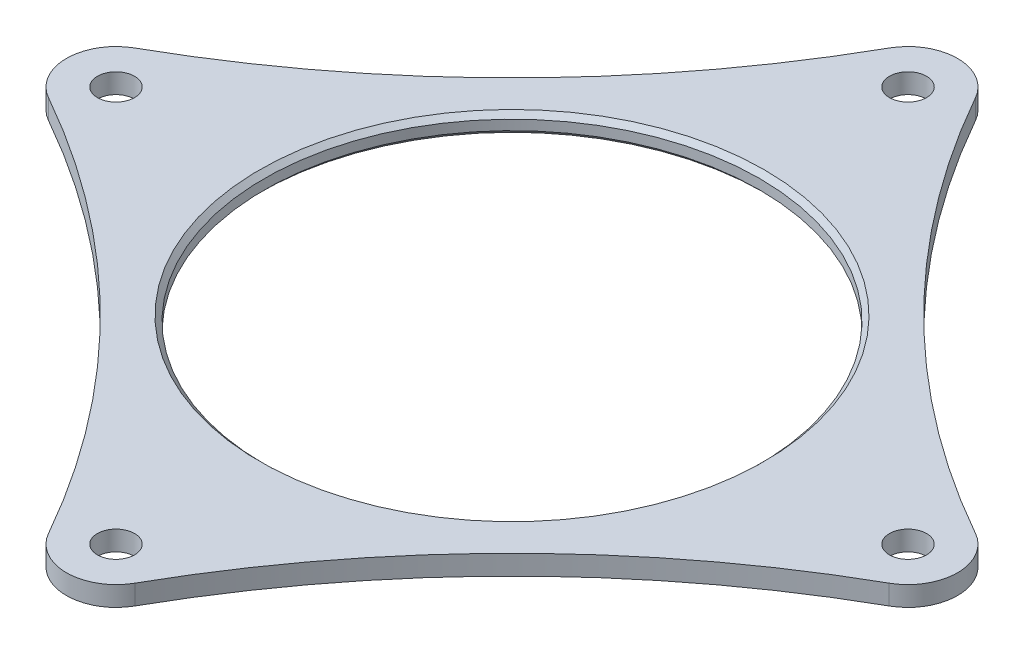
ISO-10303-21;
HEADER;
FILE_DESCRIPTION(('STEP AP214'),'2;1');
FILE_NAME('part.step','',(''),(''),'','','');
FILE_SCHEMA(('AUTOMOTIVE_DESIGN { 1 0 10303 214 1 1 1 1 }'));
ENDSEC;
DATA;
#1=APPLICATION_CONTEXT('core data for automotive mechanical design processes');
#2=APPLICATION_PROTOCOL_DEFINITION('international standard','automotive_design',2000,#1);
#3=PRODUCT_CONTEXT('',#1,'mechanical');
#4=PRODUCT('Part','Part','',(#3));
#5=PRODUCT_RELATED_PRODUCT_CATEGORY('part','',(#4));
#6=PRODUCT_DEFINITION_FORMATION('','',#4);
#7=PRODUCT_DEFINITION_CONTEXT('part definition',#1,'design');
#8=PRODUCT_DEFINITION('design','',#6,#7);
#9=PRODUCT_DEFINITION_SHAPE('','',#8);
#10=(LENGTH_UNIT() NAMED_UNIT(*) SI_UNIT(.MILLI.,.METRE.));
#11=(NAMED_UNIT(*) PLANE_ANGLE_UNIT() SI_UNIT($,.RADIAN.));
#12=(NAMED_UNIT(*) SI_UNIT($,.STERADIAN.) SOLID_ANGLE_UNIT());
#13=UNCERTAINTY_MEASURE_WITH_UNIT(LENGTH_MEASURE(1.E-05),#10,'distance_accuracy_value','');
#14=(GEOMETRIC_REPRESENTATION_CONTEXT(3) GLOBAL_UNCERTAINTY_ASSIGNED_CONTEXT((#13)) GLOBAL_UNIT_ASSIGNED_CONTEXT((#10,
#11,#12)) REPRESENTATION_CONTEXT('',''));
#15=CARTESIAN_POINT('',(0.,0.,0.));
#16=DIRECTION('',(0.,0.,1.));
#17=DIRECTION('',(1.,0.,0.));
#18=AXIS2_PLACEMENT_3D('',#15,#16,#17);
#19=CARTESIAN_POINT('',(0.,5.08,0.));
#20=DIRECTION('',(0.,-1.,0.));
#21=DIRECTION('',(0.,0.,-1.));
#22=AXIS2_PLACEMENT_3D('',#19,#20,#21);
#23=PLANE('',#22);
#24=CARTESIAN_POINT('',(0.,5.08,0.));
#25=DIRECTION('',(0.,-1.,0.));
#26=DIRECTION('',(0.,0.,-1.));
#27=AXIS2_PLACEMENT_3D('',#24,#25,#26);
#28=CIRCLE('',#27,64.77);
#29=CARTESIAN_POINT('',(0.,5.08,-64.77));
#30=VERTEX_POINT('',#29);
#31=EDGE_CURVE('E11',#30,#30,#28,.T.);
#32=ORIENTED_EDGE('',*,*,#31,.T.);
#33=EDGE_LOOP('',(#32));
#34=FACE_BOUND('',#33,.T.);
#35=CARTESIAN_POINT('',(0.,5.08,101.6));
#36=DIRECTION('',(0.,-1.,0.));
#37=DIRECTION('',(0.,0.,-1.));
#38=AXIS2_PLACEMENT_3D('',#35,#36,#37);
#39=CIRCLE('',#38,12.7);
#40=CARTESIAN_POINT('',(11.0673543097703,5.08,107.829259071674));
#41=VERTEX_POINT('',#40);
#42=CARTESIAN_POINT('',(-11.0673543097692,5.08,107.829259071674));
#43=VERTEX_POINT('',#42);
#44=EDGE_CURVE('E108',#41,#43,#39,.T.);
#45=ORIENTED_EDGE('',*,*,#44,.F.);
#46=CARTESIAN_POINT('',(232.414440505156,5.08,232.414440505151));
#47=DIRECTION('',(0.,1.,0.));
#48=DIRECTION('',(-1.,0.,0.));
#49=AXIS2_PLACEMENT_3D('',#46,#47,#48);
#50=CIRCLE('',#49,254.);
#51=CARTESIAN_POINT('',(107.829259071674,5.08,11.0673543097681));
#52=VERTEX_POINT('',#51);
#53=EDGE_CURVE('E192',#52,#41,#50,.T.);
#54=ORIENTED_EDGE('',*,*,#53,.F.);
#55=CARTESIAN_POINT('',(101.6,5.08,0.));
#56=DIRECTION('',(0.,-1.,0.));
#57=DIRECTION('',(0.,0.,1.));
#58=AXIS2_PLACEMENT_3D('',#55,#56,#57);
#59=CIRCLE('',#58,12.7);
#60=CARTESIAN_POINT('',(107.829259071674,5.08,-11.0673543097692));
#61=VERTEX_POINT('',#60);
#62=EDGE_CURVE('E142',#61,#52,#59,.T.);
#63=ORIENTED_EDGE('',*,*,#62,.F.);
#64=CARTESIAN_POINT('',(232.414440505154,5.08,-232.414440505154));
#65=DIRECTION('',(0.,1.,0.));
#66=DIRECTION('',(0.,0.,1.));
#67=AXIS2_PLACEMENT_3D('',#64,#65,#66);
#68=CIRCLE('',#67,254.);
#69=CARTESIAN_POINT('',(11.0673543097692,5.08,-107.829259071674));
#70=VERTEX_POINT('',#69);
#71=EDGE_CURVE('E146',#70,#61,#68,.T.);
#72=ORIENTED_EDGE('',*,*,#71,.F.);
#73=CARTESIAN_POINT('',(0.,5.08,-101.6));
#74=DIRECTION('',(0.,-1.,0.));
#75=DIRECTION('',(0.,0.,1.));
#76=AXIS2_PLACEMENT_3D('',#73,#74,#75);
#77=CIRCLE('',#76,12.7);
#78=CARTESIAN_POINT('',(-11.0673543097696,5.08,-107.829259071674));
#79=VERTEX_POINT('',#78);
#80=EDGE_CURVE('E151',#79,#70,#77,.T.);
#81=ORIENTED_EDGE('',*,*,#80,.F.);
#82=CARTESIAN_POINT('',(-232.414440505154,5.08,-232.414440505153));
#83=DIRECTION('',(0.,1.,0.));
#84=DIRECTION('',(1.,0.,0.));
#85=AXIS2_PLACEMENT_3D('',#82,#83,#84);
#86=CIRCLE('',#85,254.);
#87=CARTESIAN_POINT('',(-107.829259071674,5.08,-11.0673543097688));
#88=VERTEX_POINT('',#87);
#89=EDGE_CURVE('E133',#88,#79,#86,.T.);
#90=ORIENTED_EDGE('',*,*,#89,.F.);
#91=CARTESIAN_POINT('',(-101.6,5.08,3.55777139112361E-13));
#92=DIRECTION('',(0.,-1.,0.));
#93=DIRECTION('',(1.,0.,0.));
#94=AXIS2_PLACEMENT_3D('',#91,#92,#93);
#95=CIRCLE('',#94,12.7);
#96=CARTESIAN_POINT('',(-107.829259071674,5.08,11.0673543097692));
#97=VERTEX_POINT('',#96);
#98=EDGE_CURVE('E136',#97,#88,#95,.T.);
#99=ORIENTED_EDGE('',*,*,#98,.F.);
#100=CARTESIAN_POINT('',(-232.414440505154,5.08,232.414440505154));
#101=DIRECTION('',(0.,1.,0.));
#102=DIRECTION('',(0.,0.,-1.));
#103=AXIS2_PLACEMENT_3D('',#100,#101,#102);
#104=CIRCLE('',#103,254.);
#105=EDGE_CURVE('E138',#43,#97,#104,.T.);
#106=ORIENTED_EDGE('',*,*,#105,.F.);
#107=EDGE_LOOP('',(#45,#54,#63,#72,#81,#90,#99,#106));
#108=FACE_BOUND('',#107,.T.);
#109=CARTESIAN_POINT('',(101.6,5.08,0.));
#110=DIRECTION('',(0.,1.,0.));
#111=DIRECTION('',(0.,0.,1.));
#112=AXIS2_PLACEMENT_3D('',#109,#110,#111);
#113=CIRCLE('',#112,4.76249999999999);
#114=CARTESIAN_POINT('',(101.6,5.08,4.76249999999999));
#115=VERTEX_POINT('',#114);
#116=EDGE_CURVE('E193',#115,#115,#113,.T.);
#117=ORIENTED_EDGE('',*,*,#116,.F.);
#118=EDGE_LOOP('',(#117));
#119=FACE_BOUND('',#118,.T.);
#120=CARTESIAN_POINT('',(-3.54734504026462E-13,5.08,-101.6));
#121=DIRECTION('',(0.,1.,0.));
#122=DIRECTION('',(0.,0.,1.));
#123=AXIS2_PLACEMENT_3D('',#120,#121,#122);
#124=CIRCLE('',#123,4.76249999999999);
#125=CARTESIAN_POINT('',(-3.54734504026462E-13,5.08,-96.8375));
#126=VERTEX_POINT('',#125);
#127=EDGE_CURVE('E384',#126,#126,#124,.T.);
#128=ORIENTED_EDGE('',*,*,#127,.F.);
#129=EDGE_LOOP('',(#128));
#130=FACE_BOUND('',#129,.T.);
#131=CARTESIAN_POINT('',(-101.6,5.08,0.));
#132=DIRECTION('',(0.,1.,0.));
#133=DIRECTION('',(0.,0.,1.));
#134=AXIS2_PLACEMENT_3D('',#131,#132,#133);
#135=CIRCLE('',#134,4.76249999999999);
#136=CARTESIAN_POINT('',(-101.6,5.08,4.76249999999999));
#137=VERTEX_POINT('',#136);
#138=EDGE_CURVE('E377',#137,#137,#135,.T.);
#139=ORIENTED_EDGE('',*,*,#138,.F.);
#140=EDGE_LOOP('',(#139));
#141=FACE_BOUND('',#140,.T.);
#142=CARTESIAN_POINT('',(1.06420351207939E-12,5.08,101.6));
#143=DIRECTION('',(0.,1.,0.));
#144=DIRECTION('',(0.,0.,1.));
#145=AXIS2_PLACEMENT_3D('',#142,#143,#144);
#146=CIRCLE('',#145,4.76249999999999);
#147=CARTESIAN_POINT('',(1.06420351207939E-12,5.08,106.3625));
#148=VERTEX_POINT('',#147);
#149=EDGE_CURVE('E376',#148,#148,#146,.T.);
#150=ORIENTED_EDGE('',*,*,#149,.F.);
#151=EDGE_LOOP('',(#150));
#152=FACE_BOUND('',#151,.T.);
#153=ADVANCED_FACE('F32',(#34,#108,#119,#130,#141,#152),#23,.F.);
#154=CARTESIAN_POINT('',(0.,0.,0.));
#155=DIRECTION('',(0.,-1.,0.));
#156=DIRECTION('',(0.,0.,-1.));
#157=AXIS2_PLACEMENT_3D('',#154,#155,#156);
#158=PLANE('',#157);
#159=CARTESIAN_POINT('',(0.,0.,0.));
#160=DIRECTION('',(0.,-1.,0.));
#161=DIRECTION('',(0.,0.,-1.));
#162=AXIS2_PLACEMENT_3D('',#159,#160,#161);
#163=CIRCLE('',#162,64.77);
#164=CARTESIAN_POINT('',(0.,0.,-64.77));
#165=VERTEX_POINT('',#164);
#166=EDGE_CURVE('E155',#165,#165,#163,.F.);
#167=ORIENTED_EDGE('',*,*,#166,.T.);
#168=EDGE_LOOP('',(#167));
#169=FACE_BOUND('',#168,.T.);
#170=CARTESIAN_POINT('',(1.06420351207939E-12,0.,101.6));
#171=DIRECTION('',(0.,-1.,0.));
#172=DIRECTION('',(0.,0.,-1.));
#173=AXIS2_PLACEMENT_3D('',#170,#171,#172);
#174=CIRCLE('',#173,4.76249999999999);
#175=CARTESIAN_POINT('',(1.06420351207939E-12,0.,96.8375));
#176=VERTEX_POINT('',#175);
#177=EDGE_CURVE('E179',#176,#176,#174,.T.);
#178=ORIENTED_EDGE('',*,*,#177,.F.);
#179=EDGE_LOOP('',(#178));
#180=FACE_BOUND('',#179,.T.);
#181=CARTESIAN_POINT('',(-101.6,0.,0.));
#182=DIRECTION('',(0.,-1.,0.));
#183=DIRECTION('',(0.,0.,-1.));
#184=AXIS2_PLACEMENT_3D('',#181,#182,#183);
#185=CIRCLE('',#184,4.7625);
#186=CARTESIAN_POINT('',(-101.6,0.,-4.7625));
#187=VERTEX_POINT('',#186);
#188=EDGE_CURVE('E183',#187,#187,#185,.T.);
#189=ORIENTED_EDGE('',*,*,#188,.F.);
#190=EDGE_LOOP('',(#189));
#191=FACE_BOUND('',#190,.T.);
#192=CARTESIAN_POINT('',(-3.54734504026462E-13,0.,-101.6));
#193=DIRECTION('',(0.,-1.,0.));
#194=DIRECTION('',(0.,0.,-1.));
#195=AXIS2_PLACEMENT_3D('',#192,#193,#194);
#196=CIRCLE('',#195,4.76249999999999);
#197=CARTESIAN_POINT('',(-3.54734504026462E-13,0.,-106.3625));
#198=VERTEX_POINT('',#197);
#199=EDGE_CURVE('E187',#198,#198,#196,.T.);
#200=ORIENTED_EDGE('',*,*,#199,.F.);
#201=EDGE_LOOP('',(#200));
#202=FACE_BOUND('',#201,.T.);
#203=CARTESIAN_POINT('',(101.6,0.,0.));
#204=DIRECTION('',(0.,-1.,0.));
#205=DIRECTION('',(0.,0.,-1.));
#206=AXIS2_PLACEMENT_3D('',#203,#204,#205);
#207=CIRCLE('',#206,4.7625);
#208=CARTESIAN_POINT('',(101.6,0.,-4.7625));
#209=VERTEX_POINT('',#208);
#210=EDGE_CURVE('E190',#209,#209,#207,.T.);
#211=ORIENTED_EDGE('',*,*,#210,.F.);
#212=EDGE_LOOP('',(#211));
#213=FACE_BOUND('',#212,.T.);
#214=CARTESIAN_POINT('',(232.414440505156,0.,232.414440505151));
#215=DIRECTION('',(0.,1.,0.));
#216=DIRECTION('',(-1.,0.,0.));
#217=AXIS2_PLACEMENT_3D('',#214,#215,#216);
#218=CIRCLE('',#217,254.);
#219=CARTESIAN_POINT('',(107.829259071674,0.,11.0673543097681));
#220=VERTEX_POINT('',#219);
#221=CARTESIAN_POINT('',(11.0673543097703,0.,107.829259071674));
#222=VERTEX_POINT('',#221);
#223=EDGE_CURVE('E125',#220,#222,#218,.T.);
#224=ORIENTED_EDGE('',*,*,#223,.T.);
#225=CARTESIAN_POINT('',(0.,0.,101.6));
#226=DIRECTION('',(0.,-1.,0.));
#227=DIRECTION('',(0.,0.,-1.));
#228=AXIS2_PLACEMENT_3D('',#225,#226,#227);
#229=CIRCLE('',#228,12.7);
#230=CARTESIAN_POINT('',(-11.0673543097692,0.,107.829259071674));
#231=VERTEX_POINT('',#230);
#232=EDGE_CURVE('E105',#222,#231,#229,.T.);
#233=ORIENTED_EDGE('',*,*,#232,.T.);
#234=CARTESIAN_POINT('',(-232.414440505154,0.,232.414440505154));
#235=DIRECTION('',(0.,1.,0.));
#236=DIRECTION('',(0.,0.,-1.));
#237=AXIS2_PLACEMENT_3D('',#234,#235,#236);
#238=CIRCLE('',#237,254.);
#239=CARTESIAN_POINT('',(-107.829259071674,0.,11.0673543097692));
#240=VERTEX_POINT('',#239);
#241=EDGE_CURVE('E113',#231,#240,#238,.T.);
#242=ORIENTED_EDGE('',*,*,#241,.T.);
#243=CARTESIAN_POINT('',(-101.6,0.,3.55777139112361E-13));
#244=DIRECTION('',(0.,-1.,0.));
#245=DIRECTION('',(1.,0.,0.));
#246=AXIS2_PLACEMENT_3D('',#243,#244,#245);
#247=CIRCLE('',#246,12.7);
#248=CARTESIAN_POINT('',(-107.829259071674,0.,-11.0673543097688));
#249=VERTEX_POINT('',#248);
#250=EDGE_CURVE('E130',#240,#249,#247,.T.);
#251=ORIENTED_EDGE('',*,*,#250,.T.);
#252=CARTESIAN_POINT('',(-232.414440505154,0.,-232.414440505153));
#253=DIRECTION('',(0.,1.,0.));
#254=DIRECTION('',(1.,0.,0.));
#255=AXIS2_PLACEMENT_3D('',#252,#253,#254);
#256=CIRCLE('',#255,254.);
#257=CARTESIAN_POINT('',(-11.0673543097696,0.,-107.829259071674));
#258=VERTEX_POINT('',#257);
#259=EDGE_CURVE('E132',#249,#258,#256,.T.);
#260=ORIENTED_EDGE('',*,*,#259,.T.);
#261=CARTESIAN_POINT('',(0.,0.,-101.6));
#262=DIRECTION('',(0.,-1.,0.));
#263=DIRECTION('',(0.,0.,1.));
#264=AXIS2_PLACEMENT_3D('',#261,#262,#263);
#265=CIRCLE('',#264,12.7);
#266=CARTESIAN_POINT('',(11.0673543097692,0.,-107.829259071674));
#267=VERTEX_POINT('',#266);
#268=EDGE_CURVE('E69',#258,#267,#265,.T.);
#269=ORIENTED_EDGE('',*,*,#268,.T.);
#270=CARTESIAN_POINT('',(232.414440505154,0.,-232.414440505154));
#271=DIRECTION('',(0.,1.,0.));
#272=DIRECTION('',(0.,0.,1.));
#273=AXIS2_PLACEMENT_3D('',#270,#271,#272);
#274=CIRCLE('',#273,254.);
#275=CARTESIAN_POINT('',(107.829259071674,0.,-11.0673543097692));
#276=VERTEX_POINT('',#275);
#277=EDGE_CURVE('E47',#267,#276,#274,.T.);
#278=ORIENTED_EDGE('',*,*,#277,.T.);
#279=CARTESIAN_POINT('',(101.6,0.,0.));
#280=DIRECTION('',(0.,-1.,0.));
#281=DIRECTION('',(0.,0.,1.));
#282=AXIS2_PLACEMENT_3D('',#279,#280,#281);
#283=CIRCLE('',#282,12.7);
#284=EDGE_CURVE('E144',#276,#220,#283,.T.);
#285=ORIENTED_EDGE('',*,*,#284,.T.);
#286=EDGE_LOOP('',(#224,#233,#242,#251,#260,#269,#278,#285));
#287=FACE_BOUND('',#286,.T.);
#288=ADVANCED_FACE('F122',(#169,#180,#191,#202,#213,#287),#158,.T.);
#289=CARTESIAN_POINT('',(0.,0.,0.));
#290=DIRECTION('',(0.,1.,0.));
#291=DIRECTION('',(0.,0.,1.));
#292=AXIS2_PLACEMENT_3D('',#289,#290,#291);
#293=CYLINDRICAL_SURFACE('',#292,63.5);
#294=CARTESIAN_POINT('',(0.,1.27000000000002,0.));
#295=DIRECTION('',(0.,-1.,0.));
#296=DIRECTION('',(0.,0.,-1.));
#297=AXIS2_PLACEMENT_3D('',#294,#295,#296);
#298=CIRCLE('',#297,63.5);
#299=CARTESIAN_POINT('',(0.,1.27000000000002,-63.5));
#300=VERTEX_POINT('',#299);
#301=EDGE_CURVE('E40',#300,#300,#298,.T.);
#302=ORIENTED_EDGE('',*,*,#301,.T.);
#303=EDGE_LOOP('',(#302));
#304=FACE_BOUND('',#303,.T.);
#305=CARTESIAN_POINT('',(0.,3.81000000000003,0.));
#306=DIRECTION('',(0.,-1.,0.));
#307=DIRECTION('',(0.,0.,-1.));
#308=AXIS2_PLACEMENT_3D('',#305,#306,#307);
#309=CIRCLE('',#308,63.5);
#310=CARTESIAN_POINT('',(0.,3.81000000000003,-63.5));
#311=VERTEX_POINT('',#310);
#312=EDGE_CURVE('E159',#311,#311,#309,.F.);
#313=ORIENTED_EDGE('',*,*,#312,.T.);
#314=EDGE_LOOP('',(#313));
#315=FACE_BOUND('',#314,.T.);
#316=ADVANCED_FACE('F164',(#304,#315),#293,.F.);
#317=CARTESIAN_POINT('',(101.6,0.,0.));
#318=DIRECTION('',(0.,1.,0.));
#319=DIRECTION('',(0.,0.,1.));
#320=AXIS2_PLACEMENT_3D('',#317,#318,#319);
#321=CYLINDRICAL_SURFACE('',#320,12.7);
#322=ORIENTED_EDGE('',*,*,#62,.T.);
#323=DIRECTION('',(0.,1.,0.));
#324=VECTOR('',#323,1.);
#325=CARTESIAN_POINT('',(107.829259071674,0.,11.0673543097681));
#326=LINE('',#325,#324);
#327=EDGE_CURVE('E201',#220,#52,#326,.T.);
#328=ORIENTED_EDGE('',*,*,#327,.F.);
#329=ORIENTED_EDGE('',*,*,#284,.F.);
#330=DIRECTION('',(0.,1.,0.));
#331=VECTOR('',#330,1.);
#332=CARTESIAN_POINT('',(107.829259071674,0.,-11.0673543097692));
#333=LINE('',#332,#331);
#334=EDGE_CURVE('E53',#276,#61,#333,.T.);
#335=ORIENTED_EDGE('',*,*,#334,.T.);
#336=EDGE_LOOP('',(#322,#328,#329,#335));
#337=FACE_BOUND('',#336,.T.);
#338=ADVANCED_FACE('F219',(#337),#321,.T.);
#339=CARTESIAN_POINT('',(232.414440505154,0.,-232.414440505154));
#340=DIRECTION('',(0.,1.,0.));
#341=DIRECTION('',(0.,0.,1.));
#342=AXIS2_PLACEMENT_3D('',#339,#340,#341);
#343=CYLINDRICAL_SURFACE('',#342,254.);
#344=ORIENTED_EDGE('',*,*,#71,.T.);
#345=ORIENTED_EDGE('',*,*,#334,.F.);
#346=ORIENTED_EDGE('',*,*,#277,.F.);
#347=DIRECTION('',(0.,1.,0.));
#348=VECTOR('',#347,1.);
#349=CARTESIAN_POINT('',(11.0673543097692,0.,-107.829259071674));
#350=LINE('',#349,#348);
#351=EDGE_CURVE('E61',#267,#70,#350,.T.);
#352=ORIENTED_EDGE('',*,*,#351,.T.);
#353=EDGE_LOOP('',(#344,#345,#346,#352));
#354=FACE_BOUND('',#353,.T.);
#355=ADVANCED_FACE('F217',(#354),#343,.F.);
#356=CARTESIAN_POINT('',(0.,0.,-101.6));
#357=DIRECTION('',(0.,1.,0.));
#358=DIRECTION('',(0.,0.,1.));
#359=AXIS2_PLACEMENT_3D('',#356,#357,#358);
#360=CYLINDRICAL_SURFACE('',#359,12.7);
#361=ORIENTED_EDGE('',*,*,#80,.T.);
#362=ORIENTED_EDGE('',*,*,#351,.F.);
#363=ORIENTED_EDGE('',*,*,#268,.F.);
#364=DIRECTION('',(0.,1.,0.));
#365=VECTOR('',#364,1.);
#366=CARTESIAN_POINT('',(-11.0673543097696,0.,-107.829259071674));
#367=LINE('',#366,#365);
#368=EDGE_CURVE('E140',#258,#79,#367,.T.);
#369=ORIENTED_EDGE('',*,*,#368,.T.);
#370=EDGE_LOOP('',(#361,#362,#363,#369));
#371=FACE_BOUND('',#370,.T.);
#372=ADVANCED_FACE('F214',(#371),#360,.T.);
#373=CARTESIAN_POINT('',(-232.414440505154,0.,-232.414440505153));
#374=DIRECTION('',(0.,1.,0.));
#375=DIRECTION('',(0.,0.,1.));
#376=AXIS2_PLACEMENT_3D('',#373,#374,#375);
#377=CYLINDRICAL_SURFACE('',#376,254.);
#378=ORIENTED_EDGE('',*,*,#89,.T.);
#379=ORIENTED_EDGE('',*,*,#368,.F.);
#380=ORIENTED_EDGE('',*,*,#259,.F.);
#381=DIRECTION('',(0.,1.,0.));
#382=VECTOR('',#381,1.);
#383=CARTESIAN_POINT('',(-107.829259071674,0.,-11.0673543097688));
#384=LINE('',#383,#382);
#385=EDGE_CURVE('E80',#249,#88,#384,.T.);
#386=ORIENTED_EDGE('',*,*,#385,.T.);
#387=EDGE_LOOP('',(#378,#379,#380,#386));
#388=FACE_BOUND('',#387,.T.);
#389=ADVANCED_FACE('F213',(#388),#377,.F.);
#390=CARTESIAN_POINT('',(-101.6,0.,3.55777139112361E-13));
#391=DIRECTION('',(0.,1.,0.));
#392=DIRECTION('',(0.,0.,1.));
#393=AXIS2_PLACEMENT_3D('',#390,#391,#392);
#394=CYLINDRICAL_SURFACE('',#393,12.7);
#395=ORIENTED_EDGE('',*,*,#98,.T.);
#396=ORIENTED_EDGE('',*,*,#385,.F.);
#397=ORIENTED_EDGE('',*,*,#250,.F.);
#398=DIRECTION('',(0.,1.,0.));
#399=VECTOR('',#398,1.);
#400=CARTESIAN_POINT('',(-107.829259071674,0.,11.0673543097692));
#401=LINE('',#400,#399);
#402=EDGE_CURVE('E116',#240,#97,#401,.T.);
#403=ORIENTED_EDGE('',*,*,#402,.T.);
#404=EDGE_LOOP('',(#395,#396,#397,#403));
#405=FACE_BOUND('',#404,.T.);
#406=ADVANCED_FACE('F212',(#405),#394,.T.);
#407=CARTESIAN_POINT('',(-232.414440505154,0.,232.414440505154));
#408=DIRECTION('',(0.,1.,0.));
#409=DIRECTION('',(0.,0.,1.));
#410=AXIS2_PLACEMENT_3D('',#407,#408,#409);
#411=CYLINDRICAL_SURFACE('',#410,254.);
#412=ORIENTED_EDGE('',*,*,#105,.T.);
#413=ORIENTED_EDGE('',*,*,#402,.F.);
#414=ORIENTED_EDGE('',*,*,#241,.F.);
#415=DIRECTION('',(0.,1.,0.));
#416=VECTOR('',#415,1.);
#417=CARTESIAN_POINT('',(-11.0673543097692,0.,107.829259071674));
#418=LINE('',#417,#416);
#419=EDGE_CURVE('E90',#231,#43,#418,.T.);
#420=ORIENTED_EDGE('',*,*,#419,.T.);
#421=EDGE_LOOP('',(#412,#413,#414,#420));
#422=FACE_BOUND('',#421,.T.);
#423=ADVANCED_FACE('F114',(#422),#411,.F.);
#424=CARTESIAN_POINT('',(0.,0.,101.6));
#425=DIRECTION('',(0.,1.,0.));
#426=DIRECTION('',(0.,0.,1.));
#427=AXIS2_PLACEMENT_3D('',#424,#425,#426);
#428=CYLINDRICAL_SURFACE('',#427,12.7);
#429=ORIENTED_EDGE('',*,*,#44,.T.);
#430=ORIENTED_EDGE('',*,*,#419,.F.);
#431=ORIENTED_EDGE('',*,*,#232,.F.);
#432=DIRECTION('',(0.,1.,0.));
#433=VECTOR('',#432,1.);
#434=CARTESIAN_POINT('',(11.0673543097703,0.,107.829259071674));
#435=LINE('',#434,#433);
#436=EDGE_CURVE('E119',#222,#41,#435,.T.);
#437=ORIENTED_EDGE('',*,*,#436,.T.);
#438=EDGE_LOOP('',(#429,#430,#431,#437));
#439=FACE_BOUND('',#438,.T.);
#440=ADVANCED_FACE('F102',(#439),#428,.T.);
#441=CARTESIAN_POINT('',(232.414440505156,0.,232.414440505151));
#442=DIRECTION('',(0.,1.,0.));
#443=DIRECTION('',(0.,0.,1.));
#444=AXIS2_PLACEMENT_3D('',#441,#442,#443);
#445=CYLINDRICAL_SURFACE('',#444,254.);
#446=ORIENTED_EDGE('',*,*,#53,.T.);
#447=ORIENTED_EDGE('',*,*,#436,.F.);
#448=ORIENTED_EDGE('',*,*,#223,.F.);
#449=ORIENTED_EDGE('',*,*,#327,.T.);
#450=EDGE_LOOP('',(#446,#447,#448,#449));
#451=FACE_BOUND('',#450,.T.);
#452=ADVANCED_FACE('F289',(#451),#445,.F.);
#453=CARTESIAN_POINT('',(101.6,5.08,0.));
#454=DIRECTION('',(0.,1.,0.));
#455=DIRECTION('',(0.,0.,1.));
#456=AXIS2_PLACEMENT_3D('',#453,#454,#455);
#457=CYLINDRICAL_SURFACE('',#456,4.7625);
#458=ORIENTED_EDGE('',*,*,#116,.T.);
#459=EDGE_LOOP('',(#458));
#460=FACE_BOUND('',#459,.T.);
#461=ORIENTED_EDGE('',*,*,#210,.T.);
#462=EDGE_LOOP('',(#461));
#463=FACE_BOUND('',#462,.T.);
#464=ADVANCED_FACE('F298',(#460,#463),#457,.F.);
#465=CARTESIAN_POINT('',(-3.54734504026462E-13,5.08,-101.6));
#466=DIRECTION('',(0.,1.,0.));
#467=DIRECTION('',(0.,0.,1.));
#468=AXIS2_PLACEMENT_3D('',#465,#466,#467);
#469=CYLINDRICAL_SURFACE('',#468,4.76249999999999);
#470=ORIENTED_EDGE('',*,*,#127,.T.);
#471=EDGE_LOOP('',(#470));
#472=FACE_BOUND('',#471,.T.);
#473=ORIENTED_EDGE('',*,*,#199,.T.);
#474=EDGE_LOOP('',(#473));
#475=FACE_BOUND('',#474,.T.);
#476=ADVANCED_FACE('F308',(#472,#475),#469,.F.);
#477=CARTESIAN_POINT('',(-101.6,5.08,0.));
#478=DIRECTION('',(0.,1.,0.));
#479=DIRECTION('',(0.,0.,1.));
#480=AXIS2_PLACEMENT_3D('',#477,#478,#479);
#481=CYLINDRICAL_SURFACE('',#480,4.7625);
#482=ORIENTED_EDGE('',*,*,#138,.T.);
#483=EDGE_LOOP('',(#482));
#484=FACE_BOUND('',#483,.T.);
#485=ORIENTED_EDGE('',*,*,#188,.T.);
#486=EDGE_LOOP('',(#485));
#487=FACE_BOUND('',#486,.T.);
#488=ADVANCED_FACE('F319',(#484,#487),#481,.F.);
#489=CARTESIAN_POINT('',(1.06420351207939E-12,5.08,101.6));
#490=DIRECTION('',(0.,1.,0.));
#491=DIRECTION('',(0.,0.,1.));
#492=AXIS2_PLACEMENT_3D('',#489,#490,#491);
#493=CYLINDRICAL_SURFACE('',#492,4.76249999999999);
#494=ORIENTED_EDGE('',*,*,#149,.T.);
#495=EDGE_LOOP('',(#494));
#496=FACE_BOUND('',#495,.T.);
#497=ORIENTED_EDGE('',*,*,#177,.T.);
#498=EDGE_LOOP('',(#497));
#499=FACE_BOUND('',#498,.T.);
#500=ADVANCED_FACE('F170',(#496,#499),#493,.F.);
#501=CARTESIAN_POINT('',(0.,0.,0.));
#502=DIRECTION('',(0.,-1.,0.));
#503=DIRECTION('',(0.,0.,-1.));
#504=AXIS2_PLACEMENT_3D('',#501,#502,#503);
#505=CONICAL_SURFACE('',#504,64.77,0.785398163397448);
#506=ORIENTED_EDGE('',*,*,#301,.F.);
#507=EDGE_LOOP('',(#506));
#508=FACE_BOUND('',#507,.T.);
#509=ORIENTED_EDGE('',*,*,#166,.F.);
#510=EDGE_LOOP('',(#509));
#511=FACE_BOUND('',#510,.T.);
#512=ADVANCED_FACE('F167',(#508,#511),#505,.F.);
#513=CARTESIAN_POINT('',(0.,3.81000000000003,0.));
#514=DIRECTION('',(0.,1.,0.));
#515=DIRECTION('',(0.,0.,1.));
#516=AXIS2_PLACEMENT_3D('',#513,#514,#515);
#517=CONICAL_SURFACE('',#516,63.5,0.785398163397448);
#518=ORIENTED_EDGE('',*,*,#31,.F.);
#519=EDGE_LOOP('',(#518));
#520=FACE_BOUND('',#519,.T.);
#521=ORIENTED_EDGE('',*,*,#312,.F.);
#522=EDGE_LOOP('',(#521));
#523=FACE_BOUND('',#522,.T.);
#524=ADVANCED_FACE('F34',(#520,#523),#517,.F.);
#525=CLOSED_SHELL('',(#153,#288,#316,#338,#355,#372,#389,#406,#423,#440,#452,#464,#476,#488,
#500,#512,#524));
#526=MANIFOLD_SOLID_BREP('B2',#525);
#527=ADVANCED_BREP_SHAPE_REPRESENTATION('',(#18,#526),#14);
#528=SHAPE_DEFINITION_REPRESENTATION(#9,#527);
ENDSEC;
END-ISO-10303-21;
